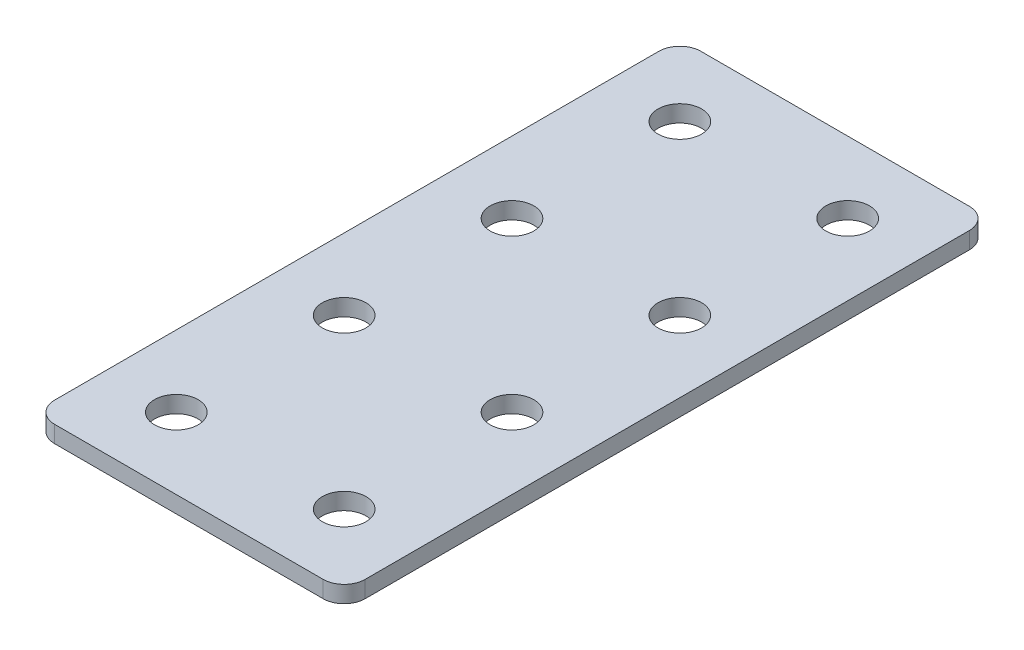
ISO-10303-21;
HEADER;
FILE_DESCRIPTION(('STEP AP214'),'2;1');
FILE_NAME('part.step','',(''),(''),'','','');
FILE_SCHEMA(('AUTOMOTIVE_DESIGN { 1 0 10303 214 1 1 1 1 }'));
ENDSEC;
DATA;
#1=APPLICATION_CONTEXT('core data for automotive mechanical design processes');
#2=APPLICATION_PROTOCOL_DEFINITION('international standard','automotive_design',2000,#1);
#3=PRODUCT_CONTEXT('',#1,'mechanical');
#4=PRODUCT('Part','Part','',(#3));
#5=PRODUCT_RELATED_PRODUCT_CATEGORY('part','',(#4));
#6=PRODUCT_DEFINITION_FORMATION('','',#4);
#7=PRODUCT_DEFINITION_CONTEXT('part definition',#1,'design');
#8=PRODUCT_DEFINITION('design','',#6,#7);
#9=PRODUCT_DEFINITION_SHAPE('','',#8);
#10=(LENGTH_UNIT() NAMED_UNIT(*) SI_UNIT(.MILLI.,.METRE.));
#11=(NAMED_UNIT(*) PLANE_ANGLE_UNIT() SI_UNIT($,.RADIAN.));
#12=(NAMED_UNIT(*) SI_UNIT($,.STERADIAN.) SOLID_ANGLE_UNIT());
#13=UNCERTAINTY_MEASURE_WITH_UNIT(LENGTH_MEASURE(1.E-05),#10,'distance_accuracy_value','');
#14=(GEOMETRIC_REPRESENTATION_CONTEXT(3) GLOBAL_UNCERTAINTY_ASSIGNED_CONTEXT((#13)) GLOBAL_UNIT_ASSIGNED_CONTEXT((#10,
#11,#12)) REPRESENTATION_CONTEXT('',''));
#15=CARTESIAN_POINT('',(0.,0.,0.));
#16=DIRECTION('',(0.,0.,1.));
#17=DIRECTION('',(1.,0.,0.));
#18=AXIS2_PLACEMENT_3D('',#15,#16,#17);
#19=CARTESIAN_POINT('',(-1.93702400832763,1.92462627726309,-30.9871269738255));
#20=DIRECTION('',(0.,-1.,0.));
#21=DIRECTION('',(0.,0.,-1.));
#22=AXIS2_PLACEMENT_3D('',#19,#20,#21);
#23=PLANE('',#22);
#24=CARTESIAN_POINT('',(8.06297599167238,1.92462627726309,29.0128730261745));
#25=DIRECTION('',(0.,1.,0.));
#26=DIRECTION('',(0.,0.,1.));
#27=AXIS2_PLACEMENT_3D('',#24,#25,#26);
#28=CIRCLE('',#27,2.6);
#29=CARTESIAN_POINT('',(8.06297599167238,1.92462627726309,31.6128730261745));
#30=VERTEX_POINT('',#29);
#31=EDGE_CURVE('E189',#30,#30,#28,.T.);
#32=ORIENTED_EDGE('',*,*,#31,.T.);
#33=EDGE_LOOP('',(#32));
#34=FACE_BOUND('',#33,.T.);
#35=CARTESIAN_POINT('',(-11.9370240083277,1.92462627726309,29.0128730261745));
#36=DIRECTION('',(0.,1.,0.));
#37=DIRECTION('',(0.,0.,1.));
#38=AXIS2_PLACEMENT_3D('',#35,#36,#37);
#39=CIRCLE('',#38,2.6);
#40=CARTESIAN_POINT('',(-11.9370240083277,1.92462627726309,31.6128730261745));
#41=VERTEX_POINT('',#40);
#42=EDGE_CURVE('E183',#41,#41,#39,.T.);
#43=ORIENTED_EDGE('',*,*,#42,.T.);
#44=EDGE_LOOP('',(#43));
#45=FACE_BOUND('',#44,.T.);
#46=CARTESIAN_POINT('',(8.06297599167239,1.92462627726309,9.01287302617452));
#47=DIRECTION('',(0.,1.,0.));
#48=DIRECTION('',(0.,0.,1.));
#49=AXIS2_PLACEMENT_3D('',#46,#47,#48);
#50=CIRCLE('',#49,2.6);
#51=CARTESIAN_POINT('',(8.06297599167239,1.92462627726309,11.6128730261745));
#52=VERTEX_POINT('',#51);
#53=EDGE_CURVE('E177',#52,#52,#50,.T.);
#54=ORIENTED_EDGE('',*,*,#53,.T.);
#55=EDGE_LOOP('',(#54));
#56=FACE_BOUND('',#55,.T.);
#57=CARTESIAN_POINT('',(-11.9370240083277,1.92462627726309,9.01287302617452));
#58=DIRECTION('',(0.,1.,0.));
#59=DIRECTION('',(0.,0.,1.));
#60=AXIS2_PLACEMENT_3D('',#57,#58,#59);
#61=CIRCLE('',#60,2.6);
#62=CARTESIAN_POINT('',(-11.9370240083277,1.92462627726309,11.6128730261745));
#63=VERTEX_POINT('',#62);
#64=EDGE_CURVE('E171',#63,#63,#61,.T.);
#65=ORIENTED_EDGE('',*,*,#64,.T.);
#66=EDGE_LOOP('',(#65));
#67=FACE_BOUND('',#66,.T.);
#68=CARTESIAN_POINT('',(8.06297599167239,1.92462627726309,-10.9871269738255));
#69=DIRECTION('',(0.,1.,0.));
#70=DIRECTION('',(0.,0.,1.));
#71=AXIS2_PLACEMENT_3D('',#68,#69,#70);
#72=CIRCLE('',#71,2.6);
#73=CARTESIAN_POINT('',(8.06297599167239,1.92462627726309,-8.38712697382549));
#74=VERTEX_POINT('',#73);
#75=EDGE_CURVE('E165',#74,#74,#72,.T.);
#76=ORIENTED_EDGE('',*,*,#75,.T.);
#77=EDGE_LOOP('',(#76));
#78=FACE_BOUND('',#77,.T.);
#79=CARTESIAN_POINT('',(-11.9370240083277,1.92462627726309,-10.9871269738255));
#80=DIRECTION('',(0.,1.,0.));
#81=DIRECTION('',(0.,0.,1.));
#82=AXIS2_PLACEMENT_3D('',#79,#80,#81);
#83=CIRCLE('',#82,2.6);
#84=CARTESIAN_POINT('',(-11.9370240083277,1.92462627726309,-8.38712697382549));
#85=VERTEX_POINT('',#84);
#86=EDGE_CURVE('E159',#85,#85,#83,.T.);
#87=ORIENTED_EDGE('',*,*,#86,.T.);
#88=EDGE_LOOP('',(#87));
#89=FACE_BOUND('',#88,.T.);
#90=CARTESIAN_POINT('',(8.06297599167239,1.92462627726309,-30.9871269738255));
#91=DIRECTION('',(0.,1.,0.));
#92=DIRECTION('',(0.,0.,1.));
#93=AXIS2_PLACEMENT_3D('',#90,#91,#92);
#94=CIRCLE('',#93,2.6);
#95=CARTESIAN_POINT('',(8.06297599167239,1.92462627726309,-28.3871269738255));
#96=VERTEX_POINT('',#95);
#97=EDGE_CURVE('E154',#96,#96,#94,.T.);
#98=ORIENTED_EDGE('',*,*,#97,.T.);
#99=EDGE_LOOP('',(#98));
#100=FACE_BOUND('',#99,.T.);
#101=CARTESIAN_POINT('',(-11.9370240083277,1.92462627726309,-30.9871269738255));
#102=DIRECTION('',(0.,1.,0.));
#103=DIRECTION('',(0.,0.,1.));
#104=AXIS2_PLACEMENT_3D('',#101,#102,#103);
#105=CIRCLE('',#104,2.6);
#106=CARTESIAN_POINT('',(-11.9370240083277,1.92462627726309,-28.3871269738255));
#107=VERTEX_POINT('',#106);
#108=EDGE_CURVE('E147',#107,#107,#105,.T.);
#109=ORIENTED_EDGE('',*,*,#108,.T.);
#110=EDGE_LOOP('',(#109));
#111=FACE_BOUND('',#110,.T.);
#112=DIRECTION('',(0.,0.,-1.));
#113=VECTOR('',#112,1.);
#114=CARTESIAN_POINT('',(16.5629759916724,1.92462627726309,37.5128730261745));
#115=LINE('',#114,#113);
#116=CARTESIAN_POINT('',(16.5629759916724,1.92462627726309,35.0128730261745));
#117=VERTEX_POINT('',#116);
#118=CARTESIAN_POINT('',(16.5629759916724,1.92462627726309,-36.9871269738255));
#119=VERTEX_POINT('',#118);
#120=EDGE_CURVE('E106',#117,#119,#115,.T.);
#121=ORIENTED_EDGE('',*,*,#120,.F.);
#122=CARTESIAN_POINT('',(14.0629759916724,1.92462627726309,35.0128730261745));
#123=DIRECTION('',(0.,-1.,0.));
#124=DIRECTION('',(0.,0.,-1.));
#125=AXIS2_PLACEMENT_3D('',#122,#123,#124);
#126=CIRCLE('',#125,2.5);
#127=CARTESIAN_POINT('',(14.0629759916724,1.92462627726309,37.5128730261745));
#128=VERTEX_POINT('',#127);
#129=EDGE_CURVE('E128',#117,#128,#126,.T.);
#130=ORIENTED_EDGE('',*,*,#129,.T.);
#131=DIRECTION('',(1.,0.,0.));
#132=VECTOR('',#131,1.);
#133=CARTESIAN_POINT('',(-20.4370240083277,1.92462627726309,37.5128730261745));
#134=LINE('',#133,#132);
#135=CARTESIAN_POINT('',(-17.9370240083277,1.92462627726309,37.5128730261745));
#136=VERTEX_POINT('',#135);
#137=EDGE_CURVE('E110',#136,#128,#134,.T.);
#138=ORIENTED_EDGE('',*,*,#137,.F.);
#139=CARTESIAN_POINT('',(-17.9370240083277,1.92462627726309,35.0128730261745));
#140=DIRECTION('',(0.,-1.,0.));
#141=DIRECTION('',(0.,0.,-1.));
#142=AXIS2_PLACEMENT_3D('',#139,#140,#141);
#143=CIRCLE('',#142,2.5);
#144=CARTESIAN_POINT('',(-20.4370240083277,1.92462627726309,35.0128730261745));
#145=VERTEX_POINT('',#144);
#146=EDGE_CURVE('E105',#136,#145,#143,.T.);
#147=ORIENTED_EDGE('',*,*,#146,.T.);
#148=DIRECTION('',(0.,0.,1.));
#149=VECTOR('',#148,1.);
#150=CARTESIAN_POINT('',(-20.4370240083277,1.92462627726309,-39.4871269738255));
#151=LINE('',#150,#149);
#152=CARTESIAN_POINT('',(-20.4370240083277,1.92462627726309,-36.9871269738255));
#153=VERTEX_POINT('',#152);
#154=EDGE_CURVE('E137',#153,#145,#151,.T.);
#155=ORIENTED_EDGE('',*,*,#154,.F.);
#156=CARTESIAN_POINT('',(-17.9370240083277,1.92462627726309,-36.9871269738255));
#157=DIRECTION('',(0.,-1.,0.));
#158=DIRECTION('',(0.,0.,-1.));
#159=AXIS2_PLACEMENT_3D('',#156,#157,#158);
#160=CIRCLE('',#159,2.5);
#161=CARTESIAN_POINT('',(-17.9370240083277,1.92462627726309,-39.4871269738255));
#162=VERTEX_POINT('',#161);
#163=EDGE_CURVE('E31',#153,#162,#160,.T.);
#164=ORIENTED_EDGE('',*,*,#163,.T.);
#165=DIRECTION('',(-1.,0.,0.));
#166=VECTOR('',#165,1.);
#167=CARTESIAN_POINT('',(16.5629759916724,1.92462627726309,-39.4871269738255));
#168=LINE('',#167,#166);
#169=CARTESIAN_POINT('',(14.0629759916724,1.92462627726309,-39.4871269738255));
#170=VERTEX_POINT('',#169);
#171=EDGE_CURVE('E138',#170,#162,#168,.T.);
#172=ORIENTED_EDGE('',*,*,#171,.F.);
#173=CARTESIAN_POINT('',(14.0629759916724,1.92462627726309,-36.9871269738255));
#174=DIRECTION('',(0.,-1.,0.));
#175=DIRECTION('',(0.,0.,-1.));
#176=AXIS2_PLACEMENT_3D('',#173,#174,#175);
#177=CIRCLE('',#176,2.5);
#178=EDGE_CURVE('E126',#170,#119,#177,.T.);
#179=ORIENTED_EDGE('',*,*,#178,.T.);
#180=EDGE_LOOP('',(#121,#130,#138,#147,#155,#164,#172,#179));
#181=FACE_BOUND('',#180,.T.);
#182=ADVANCED_FACE('F16',(#34,#45,#56,#67,#78,#89,#100,#111,#181),#23,.T.);
#183=CARTESIAN_POINT('',(16.5629759916724,1.92462627726309,-39.4871269738255));
#184=DIRECTION('',(0.,0.,-1.));
#185=DIRECTION('',(-1.,0.,0.));
#186=AXIS2_PLACEMENT_3D('',#183,#184,#185);
#187=PLANE('',#186);
#188=DIRECTION('',(-1.,0.,0.));
#189=VECTOR('',#188,1.);
#190=CARTESIAN_POINT('',(16.5629759916724,3.92462627726309,-39.4871269738255));
#191=LINE('',#190,#189);
#192=CARTESIAN_POINT('',(14.0629759916724,3.92462627726309,-39.4871269738255));
#193=VERTEX_POINT('',#192);
#194=CARTESIAN_POINT('',(-17.9370240083277,3.92462627726309,-39.4871269738255));
#195=VERTEX_POINT('',#194);
#196=EDGE_CURVE('E144',#193,#195,#191,.T.);
#197=ORIENTED_EDGE('',*,*,#196,.F.);
#198=DIRECTION('',(0.,1.,0.));
#199=VECTOR('',#198,1.);
#200=CARTESIAN_POINT('',(14.0629759916724,1.92462627726309,-39.4871269738255));
#201=LINE('',#200,#199);
#202=EDGE_CURVE('E38',#193,#170,#201,.F.);
#203=ORIENTED_EDGE('',*,*,#202,.T.);
#204=ORIENTED_EDGE('',*,*,#171,.T.);
#205=DIRECTION('',(0.,1.,0.));
#206=VECTOR('',#205,1.);
#207=CARTESIAN_POINT('',(-17.9370240083277,1.92462627726309,-39.4871269738255));
#208=LINE('',#207,#206);
#209=EDGE_CURVE('E130',#162,#195,#208,.T.);
#210=ORIENTED_EDGE('',*,*,#209,.T.);
#211=EDGE_LOOP('',(#197,#203,#204,#210));
#212=FACE_BOUND('',#211,.T.);
#213=ADVANCED_FACE('F239',(#212),#187,.T.);
#214=CARTESIAN_POINT('',(16.5629759916724,1.92462627726309,37.5128730261745));
#215=DIRECTION('',(1.,0.,0.));
#216=DIRECTION('',(0.,0.,-1.));
#217=AXIS2_PLACEMENT_3D('',#214,#215,#216);
#218=PLANE('',#217);
#219=DIRECTION('',(0.,0.,-1.));
#220=VECTOR('',#219,1.);
#221=CARTESIAN_POINT('',(16.5629759916724,3.92462627726309,37.5128730261745));
#222=LINE('',#221,#220);
#223=CARTESIAN_POINT('',(16.5629759916724,3.92462627726309,35.0128730261745));
#224=VERTEX_POINT('',#223);
#225=CARTESIAN_POINT('',(16.5629759916724,3.92462627726309,-36.9871269738255));
#226=VERTEX_POINT('',#225);
#227=EDGE_CURVE('E102',#224,#226,#222,.T.);
#228=ORIENTED_EDGE('',*,*,#227,.F.);
#229=DIRECTION('',(0.,1.,0.));
#230=VECTOR('',#229,1.);
#231=CARTESIAN_POINT('',(16.5629759916724,1.92462627726309,35.0128730261745));
#232=LINE('',#231,#230);
#233=EDGE_CURVE('E122',#224,#117,#232,.F.);
#234=ORIENTED_EDGE('',*,*,#233,.T.);
#235=ORIENTED_EDGE('',*,*,#120,.T.);
#236=DIRECTION('',(0.,1.,0.));
#237=VECTOR('',#236,1.);
#238=CARTESIAN_POINT('',(16.5629759916724,1.92462627726309,-36.9871269738255));
#239=LINE('',#238,#237);
#240=EDGE_CURVE('E119',#119,#226,#239,.T.);
#241=ORIENTED_EDGE('',*,*,#240,.T.);
#242=EDGE_LOOP('',(#228,#234,#235,#241));
#243=FACE_BOUND('',#242,.T.);
#244=ADVANCED_FACE('F244',(#243),#218,.T.);
#245=CARTESIAN_POINT('',(-20.4370240083277,1.92462627726309,37.5128730261745));
#246=DIRECTION('',(0.,0.,1.));
#247=DIRECTION('',(1.,0.,0.));
#248=AXIS2_PLACEMENT_3D('',#245,#246,#247);
#249=PLANE('',#248);
#250=ORIENTED_EDGE('',*,*,#137,.T.);
#251=DIRECTION('',(0.,1.,0.));
#252=VECTOR('',#251,1.);
#253=CARTESIAN_POINT('',(14.0629759916724,1.92462627726309,37.5128730261745));
#254=LINE('',#253,#252);
#255=CARTESIAN_POINT('',(14.0629759916724,3.92462627726309,37.5128730261745));
#256=VERTEX_POINT('',#255);
#257=EDGE_CURVE('E93',#128,#256,#254,.T.);
#258=ORIENTED_EDGE('',*,*,#257,.T.);
#259=DIRECTION('',(1.,0.,0.));
#260=VECTOR('',#259,1.);
#261=CARTESIAN_POINT('',(-20.4370240083277,3.92462627726309,37.5128730261745));
#262=LINE('',#261,#260);
#263=CARTESIAN_POINT('',(-17.9370240083277,3.92462627726309,37.5128730261745));
#264=VERTEX_POINT('',#263);
#265=EDGE_CURVE('E85',#264,#256,#262,.T.);
#266=ORIENTED_EDGE('',*,*,#265,.F.);
#267=DIRECTION('',(0.,1.,0.));
#268=VECTOR('',#267,1.);
#269=CARTESIAN_POINT('',(-17.9370240083277,1.92462627726309,37.5128730261745));
#270=LINE('',#269,#268);
#271=EDGE_CURVE('E99',#264,#136,#270,.F.);
#272=ORIENTED_EDGE('',*,*,#271,.T.);
#273=EDGE_LOOP('',(#250,#258,#266,#272));
#274=FACE_BOUND('',#273,.T.);
#275=ADVANCED_FACE('F98',(#274),#249,.T.);
#276=CARTESIAN_POINT('',(-20.4370240083277,1.92462627726309,-39.4871269738255));
#277=DIRECTION('',(-1.,0.,0.));
#278=DIRECTION('',(0.,0.,1.));
#279=AXIS2_PLACEMENT_3D('',#276,#277,#278);
#280=PLANE('',#279);
#281=DIRECTION('',(0.,0.,1.));
#282=VECTOR('',#281,1.);
#283=CARTESIAN_POINT('',(-20.4370240083277,3.92462627726309,-39.4871269738255));
#284=LINE('',#283,#282);
#285=CARTESIAN_POINT('',(-20.4370240083277,3.92462627726309,-36.9871269738255));
#286=VERTEX_POINT('',#285);
#287=CARTESIAN_POINT('',(-20.4370240083277,3.92462627726309,35.0128730261745));
#288=VERTEX_POINT('',#287);
#289=EDGE_CURVE('E87',#286,#288,#284,.T.);
#290=ORIENTED_EDGE('',*,*,#289,.F.);
#291=DIRECTION('',(0.,1.,0.));
#292=VECTOR('',#291,1.);
#293=CARTESIAN_POINT('',(-20.4370240083277,1.92462627726309,-36.9871269738255));
#294=LINE('',#293,#292);
#295=EDGE_CURVE('E10',#286,#153,#294,.F.);
#296=ORIENTED_EDGE('',*,*,#295,.T.);
#297=ORIENTED_EDGE('',*,*,#154,.T.);
#298=DIRECTION('',(0.,1.,0.));
#299=VECTOR('',#298,1.);
#300=CARTESIAN_POINT('',(-20.4370240083277,1.92462627726309,35.0128730261745));
#301=LINE('',#300,#299);
#302=EDGE_CURVE('E24',#145,#288,#301,.T.);
#303=ORIENTED_EDGE('',*,*,#302,.T.);
#304=EDGE_LOOP('',(#290,#296,#297,#303));
#305=FACE_BOUND('',#304,.T.);
#306=ADVANCED_FACE('F135',(#305),#280,.T.);
#307=CARTESIAN_POINT('',(-1.93702400832763,3.92462627726309,-30.9871269738255));
#308=DIRECTION('',(0.,-1.,0.));
#309=DIRECTION('',(0.,0.,-1.));
#310=AXIS2_PLACEMENT_3D('',#307,#308,#309);
#311=PLANE('',#310);
#312=CARTESIAN_POINT('',(8.06297599167238,3.92462627726309,29.0128730261745));
#313=DIRECTION('',(0.,1.,0.));
#314=DIRECTION('',(0.,0.,1.));
#315=AXIS2_PLACEMENT_3D('',#312,#313,#314);
#316=CIRCLE('',#315,2.6);
#317=CARTESIAN_POINT('',(8.06297599167238,3.92462627726309,31.6128730261745));
#318=VERTEX_POINT('',#317);
#319=EDGE_CURVE('E192',#318,#318,#316,.T.);
#320=ORIENTED_EDGE('',*,*,#319,.F.);
#321=EDGE_LOOP('',(#320));
#322=FACE_BOUND('',#321,.T.);
#323=CARTESIAN_POINT('',(-11.9370240083277,3.92462627726309,29.0128730261745));
#324=DIRECTION('',(0.,1.,0.));
#325=DIRECTION('',(0.,0.,1.));
#326=AXIS2_PLACEMENT_3D('',#323,#324,#325);
#327=CIRCLE('',#326,2.6);
#328=CARTESIAN_POINT('',(-11.9370240083277,3.92462627726309,31.6128730261745));
#329=VERTEX_POINT('',#328);
#330=EDGE_CURVE('E186',#329,#329,#327,.T.);
#331=ORIENTED_EDGE('',*,*,#330,.F.);
#332=EDGE_LOOP('',(#331));
#333=FACE_BOUND('',#332,.T.);
#334=CARTESIAN_POINT('',(8.06297599167239,3.92462627726309,9.01287302617452));
#335=DIRECTION('',(0.,1.,0.));
#336=DIRECTION('',(0.,0.,1.));
#337=AXIS2_PLACEMENT_3D('',#334,#335,#336);
#338=CIRCLE('',#337,2.6);
#339=CARTESIAN_POINT('',(8.06297599167239,3.92462627726309,11.6128730261745));
#340=VERTEX_POINT('',#339);
#341=EDGE_CURVE('E180',#340,#340,#338,.T.);
#342=ORIENTED_EDGE('',*,*,#341,.F.);
#343=EDGE_LOOP('',(#342));
#344=FACE_BOUND('',#343,.T.);
#345=CARTESIAN_POINT('',(-11.9370240083277,3.92462627726309,9.01287302617452));
#346=DIRECTION('',(0.,1.,0.));
#347=DIRECTION('',(0.,0.,1.));
#348=AXIS2_PLACEMENT_3D('',#345,#346,#347);
#349=CIRCLE('',#348,2.6);
#350=CARTESIAN_POINT('',(-11.9370240083277,3.92462627726309,11.6128730261745));
#351=VERTEX_POINT('',#350);
#352=EDGE_CURVE('E174',#351,#351,#349,.T.);
#353=ORIENTED_EDGE('',*,*,#352,.F.);
#354=EDGE_LOOP('',(#353));
#355=FACE_BOUND('',#354,.T.);
#356=CARTESIAN_POINT('',(8.06297599167239,3.92462627726309,-10.9871269738255));
#357=DIRECTION('',(0.,1.,0.));
#358=DIRECTION('',(0.,0.,1.));
#359=AXIS2_PLACEMENT_3D('',#356,#357,#358);
#360=CIRCLE('',#359,2.6);
#361=CARTESIAN_POINT('',(8.06297599167239,3.92462627726309,-8.38712697382549));
#362=VERTEX_POINT('',#361);
#363=EDGE_CURVE('E168',#362,#362,#360,.T.);
#364=ORIENTED_EDGE('',*,*,#363,.F.);
#365=EDGE_LOOP('',(#364));
#366=FACE_BOUND('',#365,.T.);
#367=CARTESIAN_POINT('',(-11.9370240083277,3.92462627726309,-10.9871269738255));
#368=DIRECTION('',(0.,1.,0.));
#369=DIRECTION('',(0.,0.,1.));
#370=AXIS2_PLACEMENT_3D('',#367,#368,#369);
#371=CIRCLE('',#370,2.6);
#372=CARTESIAN_POINT('',(-11.9370240083277,3.92462627726309,-8.38712697382549));
#373=VERTEX_POINT('',#372);
#374=EDGE_CURVE('E162',#373,#373,#371,.T.);
#375=ORIENTED_EDGE('',*,*,#374,.F.);
#376=EDGE_LOOP('',(#375));
#377=FACE_BOUND('',#376,.T.);
#378=CARTESIAN_POINT('',(8.06297599167239,3.92462627726309,-30.9871269738255));
#379=DIRECTION('',(0.,1.,0.));
#380=DIRECTION('',(0.,0.,1.));
#381=AXIS2_PLACEMENT_3D('',#378,#379,#380);
#382=CIRCLE('',#381,2.6);
#383=CARTESIAN_POINT('',(8.06297599167239,3.92462627726309,-28.3871269738255));
#384=VERTEX_POINT('',#383);
#385=EDGE_CURVE('E156',#384,#384,#382,.T.);
#386=ORIENTED_EDGE('',*,*,#385,.F.);
#387=EDGE_LOOP('',(#386));
#388=FACE_BOUND('',#387,.T.);
#389=CARTESIAN_POINT('',(-11.9370240083277,3.92462627726309,-30.9871269738255));
#390=DIRECTION('',(0.,1.,0.));
#391=DIRECTION('',(0.,0.,1.));
#392=AXIS2_PLACEMENT_3D('',#389,#390,#391);
#393=CIRCLE('',#392,2.6);
#394=CARTESIAN_POINT('',(-11.9370240083277,3.92462627726309,-28.3871269738255));
#395=VERTEX_POINT('',#394);
#396=EDGE_CURVE('E149',#395,#395,#393,.T.);
#397=ORIENTED_EDGE('',*,*,#396,.F.);
#398=EDGE_LOOP('',(#397));
#399=FACE_BOUND('',#398,.T.);
#400=ORIENTED_EDGE('',*,*,#265,.T.);
#401=CARTESIAN_POINT('',(14.0629759916724,3.92462627726309,35.0128730261745));
#402=DIRECTION('',(0.,-1.,0.));
#403=DIRECTION('',(0.,0.,-1.));
#404=AXIS2_PLACEMENT_3D('',#401,#402,#403);
#405=CIRCLE('',#404,2.5);
#406=EDGE_CURVE('E117',#256,#224,#405,.F.);
#407=ORIENTED_EDGE('',*,*,#406,.T.);
#408=ORIENTED_EDGE('',*,*,#227,.T.);
#409=CARTESIAN_POINT('',(14.0629759916724,3.92462627726309,-36.9871269738255));
#410=DIRECTION('',(0.,-1.,0.));
#411=DIRECTION('',(0.,0.,-1.));
#412=AXIS2_PLACEMENT_3D('',#409,#410,#411);
#413=CIRCLE('',#412,2.5);
#414=EDGE_CURVE('E115',#226,#193,#413,.F.);
#415=ORIENTED_EDGE('',*,*,#414,.T.);
#416=ORIENTED_EDGE('',*,*,#196,.T.);
#417=CARTESIAN_POINT('',(-17.9370240083277,3.92462627726309,-36.9871269738255));
#418=DIRECTION('',(0.,-1.,0.));
#419=DIRECTION('',(0.,0.,-1.));
#420=AXIS2_PLACEMENT_3D('',#417,#418,#419);
#421=CIRCLE('',#420,2.5);
#422=EDGE_CURVE('E92',#195,#286,#421,.F.);
#423=ORIENTED_EDGE('',*,*,#422,.T.);
#424=ORIENTED_EDGE('',*,*,#289,.T.);
#425=CARTESIAN_POINT('',(-17.9370240083277,3.92462627726309,35.0128730261745));
#426=DIRECTION('',(0.,-1.,0.));
#427=DIRECTION('',(0.,0.,-1.));
#428=AXIS2_PLACEMENT_3D('',#425,#426,#427);
#429=CIRCLE('',#428,2.5);
#430=EDGE_CURVE('E82',#288,#264,#429,.F.);
#431=ORIENTED_EDGE('',*,*,#430,.T.);
#432=EDGE_LOOP('',(#400,#407,#408,#415,#416,#423,#424,#431));
#433=FACE_BOUND('',#432,.T.);
#434=ADVANCED_FACE('F84',(#322,#333,#344,#355,#366,#377,#388,#399,#433),#311,.F.);
#435=CARTESIAN_POINT('',(-11.9370240083277,1.92462627726309,-30.9871269738255));
#436=DIRECTION('',(0.,1.,0.));
#437=DIRECTION('',(0.,0.,1.));
#438=AXIS2_PLACEMENT_3D('',#435,#436,#437);
#439=CYLINDRICAL_SURFACE('',#438,2.6);
#440=ORIENTED_EDGE('',*,*,#108,.F.);
#441=EDGE_LOOP('',(#440));
#442=FACE_BOUND('',#441,.T.);
#443=ORIENTED_EDGE('',*,*,#396,.T.);
#444=EDGE_LOOP('',(#443));
#445=FACE_BOUND('',#444,.T.);
#446=ADVANCED_FACE('F210',(#442,#445),#439,.F.);
#447=CARTESIAN_POINT('',(8.06297599167239,1.92462627726309,-30.9871269738255));
#448=DIRECTION('',(0.,1.,0.));
#449=DIRECTION('',(0.,0.,1.));
#450=AXIS2_PLACEMENT_3D('',#447,#448,#449);
#451=CYLINDRICAL_SURFACE('',#450,2.6);
#452=ORIENTED_EDGE('',*,*,#97,.F.);
#453=EDGE_LOOP('',(#452));
#454=FACE_BOUND('',#453,.T.);
#455=ORIENTED_EDGE('',*,*,#385,.T.);
#456=EDGE_LOOP('',(#455));
#457=FACE_BOUND('',#456,.T.);
#458=ADVANCED_FACE('F227',(#454,#457),#451,.F.);
#459=CARTESIAN_POINT('',(-11.9370240083277,1.92462627726309,-10.9871269738255));
#460=DIRECTION('',(0.,1.,0.));
#461=DIRECTION('',(0.,0.,1.));
#462=AXIS2_PLACEMENT_3D('',#459,#460,#461);
#463=CYLINDRICAL_SURFACE('',#462,2.6);
#464=ORIENTED_EDGE('',*,*,#86,.F.);
#465=EDGE_LOOP('',(#464));
#466=FACE_BOUND('',#465,.T.);
#467=ORIENTED_EDGE('',*,*,#374,.T.);
#468=EDGE_LOOP('',(#467));
#469=FACE_BOUND('',#468,.T.);
#470=ADVANCED_FACE('F234',(#466,#469),#463,.F.);
#471=CARTESIAN_POINT('',(8.06297599167239,1.92462627726309,-10.9871269738255));
#472=DIRECTION('',(0.,1.,0.));
#473=DIRECTION('',(0.,0.,1.));
#474=AXIS2_PLACEMENT_3D('',#471,#472,#473);
#475=CYLINDRICAL_SURFACE('',#474,2.6);
#476=ORIENTED_EDGE('',*,*,#75,.F.);
#477=EDGE_LOOP('',(#476));
#478=FACE_BOUND('',#477,.T.);
#479=ORIENTED_EDGE('',*,*,#363,.T.);
#480=EDGE_LOOP('',(#479));
#481=FACE_BOUND('',#480,.T.);
#482=ADVANCED_FACE('F307',(#478,#481),#475,.F.);
#483=CARTESIAN_POINT('',(-11.9370240083277,1.92462627726309,9.01287302617452));
#484=DIRECTION('',(0.,1.,0.));
#485=DIRECTION('',(0.,0.,1.));
#486=AXIS2_PLACEMENT_3D('',#483,#484,#485);
#487=CYLINDRICAL_SURFACE('',#486,2.6);
#488=ORIENTED_EDGE('',*,*,#64,.F.);
#489=EDGE_LOOP('',(#488));
#490=FACE_BOUND('',#489,.T.);
#491=ORIENTED_EDGE('',*,*,#352,.T.);
#492=EDGE_LOOP('',(#491));
#493=FACE_BOUND('',#492,.T.);
#494=ADVANCED_FACE('F317',(#490,#493),#487,.F.);
#495=CARTESIAN_POINT('',(8.06297599167239,1.92462627726309,9.01287302617452));
#496=DIRECTION('',(0.,1.,0.));
#497=DIRECTION('',(0.,0.,1.));
#498=AXIS2_PLACEMENT_3D('',#495,#496,#497);
#499=CYLINDRICAL_SURFACE('',#498,2.6);
#500=ORIENTED_EDGE('',*,*,#53,.F.);
#501=EDGE_LOOP('',(#500));
#502=FACE_BOUND('',#501,.T.);
#503=ORIENTED_EDGE('',*,*,#341,.T.);
#504=EDGE_LOOP('',(#503));
#505=FACE_BOUND('',#504,.T.);
#506=ADVANCED_FACE('F327',(#502,#505),#499,.F.);
#507=CARTESIAN_POINT('',(-11.9370240083277,1.92462627726309,29.0128730261745));
#508=DIRECTION('',(0.,1.,0.));
#509=DIRECTION('',(0.,0.,1.));
#510=AXIS2_PLACEMENT_3D('',#507,#508,#509);
#511=CYLINDRICAL_SURFACE('',#510,2.6);
#512=ORIENTED_EDGE('',*,*,#42,.F.);
#513=EDGE_LOOP('',(#512));
#514=FACE_BOUND('',#513,.T.);
#515=ORIENTED_EDGE('',*,*,#330,.T.);
#516=EDGE_LOOP('',(#515));
#517=FACE_BOUND('',#516,.T.);
#518=ADVANCED_FACE('F204',(#514,#517),#511,.F.);
#519=CARTESIAN_POINT('',(8.06297599167238,1.92462627726309,29.0128730261745));
#520=DIRECTION('',(0.,1.,0.));
#521=DIRECTION('',(0.,0.,1.));
#522=AXIS2_PLACEMENT_3D('',#519,#520,#521);
#523=CYLINDRICAL_SURFACE('',#522,2.6);
#524=ORIENTED_EDGE('',*,*,#31,.F.);
#525=EDGE_LOOP('',(#524));
#526=FACE_BOUND('',#525,.T.);
#527=ORIENTED_EDGE('',*,*,#319,.T.);
#528=EDGE_LOOP('',(#527));
#529=FACE_BOUND('',#528,.T.);
#530=ADVANCED_FACE('F200',(#526,#529),#523,.F.);
#531=CARTESIAN_POINT('',(14.0629759916724,1.92462627726309,35.0128730261745));
#532=DIRECTION('',(0.,1.,0.));
#533=DIRECTION('',(0.,0.,1.));
#534=AXIS2_PLACEMENT_3D('',#531,#532,#533);
#535=CYLINDRICAL_SURFACE('',#534,2.5);
#536=ORIENTED_EDGE('',*,*,#129,.F.);
#537=ORIENTED_EDGE('',*,*,#233,.F.);
#538=ORIENTED_EDGE('',*,*,#406,.F.);
#539=ORIENTED_EDGE('',*,*,#257,.F.);
#540=EDGE_LOOP('',(#536,#537,#538,#539));
#541=FACE_BOUND('',#540,.T.);
#542=ADVANCED_FACE('F203',(#541),#535,.T.);
#543=CARTESIAN_POINT('',(14.0629759916724,1.92462627726309,-36.9871269738255));
#544=DIRECTION('',(0.,1.,0.));
#545=DIRECTION('',(0.,0.,1.));
#546=AXIS2_PLACEMENT_3D('',#543,#544,#545);
#547=CYLINDRICAL_SURFACE('',#546,2.5);
#548=ORIENTED_EDGE('',*,*,#178,.F.);
#549=ORIENTED_EDGE('',*,*,#202,.F.);
#550=ORIENTED_EDGE('',*,*,#414,.F.);
#551=ORIENTED_EDGE('',*,*,#240,.F.);
#552=EDGE_LOOP('',(#548,#549,#550,#551));
#553=FACE_BOUND('',#552,.T.);
#554=ADVANCED_FACE('F249',(#553),#547,.T.);
#555=CARTESIAN_POINT('',(-17.9370240083277,1.92462627726309,-36.9871269738255));
#556=DIRECTION('',(0.,1.,0.));
#557=DIRECTION('',(0.,0.,1.));
#558=AXIS2_PLACEMENT_3D('',#555,#556,#557);
#559=CYLINDRICAL_SURFACE('',#558,2.5);
#560=ORIENTED_EDGE('',*,*,#163,.F.);
#561=ORIENTED_EDGE('',*,*,#295,.F.);
#562=ORIENTED_EDGE('',*,*,#422,.F.);
#563=ORIENTED_EDGE('',*,*,#209,.F.);
#564=EDGE_LOOP('',(#560,#561,#562,#563));
#565=FACE_BOUND('',#564,.T.);
#566=ADVANCED_FACE('F252',(#565),#559,.T.);
#567=CARTESIAN_POINT('',(-17.9370240083277,1.92462627726309,35.0128730261745));
#568=DIRECTION('',(0.,1.,0.));
#569=DIRECTION('',(0.,0.,1.));
#570=AXIS2_PLACEMENT_3D('',#567,#568,#569);
#571=CYLINDRICAL_SURFACE('',#570,2.5);
#572=ORIENTED_EDGE('',*,*,#146,.F.);
#573=ORIENTED_EDGE('',*,*,#271,.F.);
#574=ORIENTED_EDGE('',*,*,#430,.F.);
#575=ORIENTED_EDGE('',*,*,#302,.F.);
#576=EDGE_LOOP('',(#572,#573,#574,#575));
#577=FACE_BOUND('',#576,.T.);
#578=ADVANCED_FACE('F18',(#577),#571,.T.);
#579=CLOSED_SHELL('',(#182,#213,#244,#275,#306,#434,#446,#458,#470,#482,#494,#506,#518,#530,
#542,#554,#566,#578));
#580=MANIFOLD_SOLID_BREP('B1',#579);
#581=ADVANCED_BREP_SHAPE_REPRESENTATION('',(#18,#580),#14);
#582=SHAPE_DEFINITION_REPRESENTATION(#9,#581);
ENDSEC;
END-ISO-10303-21;
